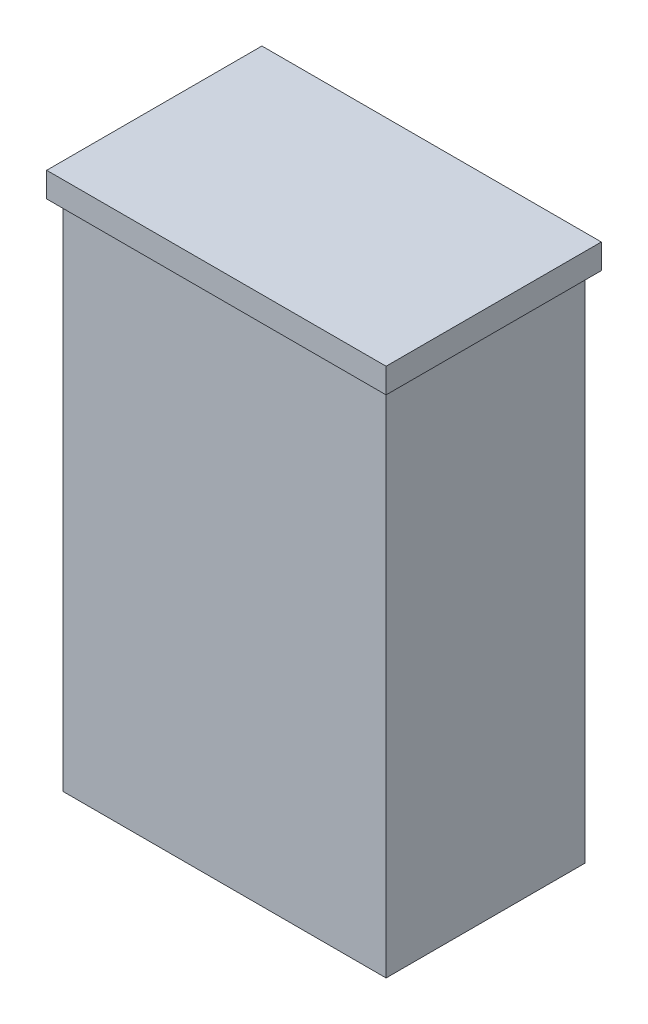
ISO-10303-21;
HEADER;
FILE_DESCRIPTION(('STEP AP214'),'2;1');
FILE_NAME('part.step','',(''),(''),'','','');
FILE_SCHEMA(('AUTOMOTIVE_DESIGN { 1 0 10303 214 1 1 1 1 }'));
ENDSEC;
DATA;
#1=APPLICATION_CONTEXT('core data for automotive mechanical design processes');
#2=APPLICATION_PROTOCOL_DEFINITION('international standard','automotive_design',2000,#1);
#3=PRODUCT_CONTEXT('',#1,'mechanical');
#4=PRODUCT('Part','Part','',(#3));
#5=PRODUCT_RELATED_PRODUCT_CATEGORY('part','',(#4));
#6=PRODUCT_DEFINITION_FORMATION('','',#4);
#7=PRODUCT_DEFINITION_CONTEXT('part definition',#1,'design');
#8=PRODUCT_DEFINITION('design','',#6,#7);
#9=PRODUCT_DEFINITION_SHAPE('','',#8);
#10=(LENGTH_UNIT() NAMED_UNIT(*) SI_UNIT(.MILLI.,.METRE.));
#11=(NAMED_UNIT(*) PLANE_ANGLE_UNIT() SI_UNIT($,.RADIAN.));
#12=(NAMED_UNIT(*) SI_UNIT($,.STERADIAN.) SOLID_ANGLE_UNIT());
#13=UNCERTAINTY_MEASURE_WITH_UNIT(LENGTH_MEASURE(1.E-05),#10,'distance_accuracy_value','');
#14=(GEOMETRIC_REPRESENTATION_CONTEXT(3) GLOBAL_UNCERTAINTY_ASSIGNED_CONTEXT((#13)) GLOBAL_UNIT_ASSIGNED_CONTEXT((#10,
#11,#12)) REPRESENTATION_CONTEXT('',''));
#15=CARTESIAN_POINT('',(0.,0.,0.));
#16=DIRECTION('',(0.,0.,1.));
#17=DIRECTION('',(1.,0.,0.));
#18=AXIS2_PLACEMENT_3D('',#15,#16,#17);
#19=CARTESIAN_POINT('',(-19.5,62.,-12.));
#20=DIRECTION('',(1.,0.,0.));
#21=DIRECTION('',(0.,0.,-1.));
#22=AXIS2_PLACEMENT_3D('',#19,#20,#21);
#23=PLANE('',#22);
#24=DIRECTION('',(0.,0.,1.));
#25=VECTOR('',#24,1.);
#26=CARTESIAN_POINT('',(-19.5,0.,-12.));
#27=LINE('',#26,#25);
#28=CARTESIAN_POINT('',(-19.5,0.,-12.));
#29=VERTEX_POINT('',#28);
#30=CARTESIAN_POINT('',(-19.5,0.,12.));
#31=VERTEX_POINT('',#30);
#32=EDGE_CURVE('E131',#29,#31,#27,.T.);
#33=ORIENTED_EDGE('',*,*,#32,.T.);
#34=DIRECTION('',(0.,-1.,0.));
#35=VECTOR('',#34,1.);
#36=CARTESIAN_POINT('',(-19.5,62.,12.));
#37=LINE('',#36,#35);
#38=CARTESIAN_POINT('',(-19.5,62.,12.));
#39=VERTEX_POINT('',#38);
#40=EDGE_CURVE('E11',#39,#31,#37,.T.);
#41=ORIENTED_EDGE('',*,*,#40,.F.);
#42=DIRECTION('',(0.,0.,1.));
#43=VECTOR('',#42,1.);
#44=CARTESIAN_POINT('',(-19.5,62.,-12.));
#45=LINE('',#44,#43);
#46=CARTESIAN_POINT('',(-19.5,62.,-12.));
#47=VERTEX_POINT('',#46);
#48=EDGE_CURVE('E140',#47,#39,#45,.T.);
#49=ORIENTED_EDGE('',*,*,#48,.F.);
#50=DIRECTION('',(0.,-1.,0.));
#51=VECTOR('',#50,1.);
#52=CARTESIAN_POINT('',(-19.5,62.,-12.));
#53=LINE('',#52,#51);
#54=EDGE_CURVE('E149',#47,#29,#53,.T.);
#55=ORIENTED_EDGE('',*,*,#54,.T.);
#56=EDGE_LOOP('',(#33,#41,#49,#55));
#57=FACE_BOUND('',#56,.T.);
#58=ADVANCED_FACE('F33',(#57),#23,.F.);
#59=CARTESIAN_POINT('',(-19.5,62.,12.));
#60=DIRECTION('',(0.,0.,-1.));
#61=DIRECTION('',(-1.,0.,0.));
#62=AXIS2_PLACEMENT_3D('',#59,#60,#61);
#63=PLANE('',#62);
#64=DIRECTION('',(1.,0.,0.));
#65=VECTOR('',#64,1.);
#66=CARTESIAN_POINT('',(-19.5,0.,12.));
#67=LINE('',#66,#65);
#68=CARTESIAN_POINT('',(19.5,0.,12.));
#69=VERTEX_POINT('',#68);
#70=EDGE_CURVE('E134',#31,#69,#67,.T.);
#71=ORIENTED_EDGE('',*,*,#70,.T.);
#72=DIRECTION('',(0.,-1.,0.));
#73=VECTOR('',#72,1.);
#74=CARTESIAN_POINT('',(19.5,62.,12.));
#75=LINE('',#74,#73);
#76=CARTESIAN_POINT('',(19.5,62.,12.));
#77=VERTEX_POINT('',#76);
#78=EDGE_CURVE('E41',#77,#69,#75,.T.);
#79=ORIENTED_EDGE('',*,*,#78,.F.);
#80=DIRECTION('',(1.,0.,0.));
#81=VECTOR('',#80,1.);
#82=CARTESIAN_POINT('',(-19.5,62.,12.));
#83=LINE('',#82,#81);
#84=EDGE_CURVE('E75',#39,#77,#83,.T.);
#85=ORIENTED_EDGE('',*,*,#84,.F.);
#86=ORIENTED_EDGE('',*,*,#40,.T.);
#87=EDGE_LOOP('',(#71,#79,#85,#86));
#88=FACE_BOUND('',#87,.T.);
#89=ADVANCED_FACE('F175',(#88),#63,.F.);
#90=CARTESIAN_POINT('',(19.5,62.,-12.));
#91=DIRECTION('',(-1.,0.,0.));
#92=DIRECTION('',(0.,0.,1.));
#93=AXIS2_PLACEMENT_3D('',#90,#91,#92);
#94=PLANE('',#93);
#95=DIRECTION('',(0.,0.,-1.));
#96=VECTOR('',#95,1.);
#97=CARTESIAN_POINT('',(19.5,0.,-12.));
#98=LINE('',#97,#96);
#99=CARTESIAN_POINT('',(19.5,0.,-12.));
#100=VERTEX_POINT('',#99);
#101=EDGE_CURVE('E65',#69,#100,#98,.T.);
#102=ORIENTED_EDGE('',*,*,#101,.T.);
#103=DIRECTION('',(0.,-1.,0.));
#104=VECTOR('',#103,1.);
#105=CARTESIAN_POINT('',(19.5,62.,-12.));
#106=LINE('',#105,#104);
#107=CARTESIAN_POINT('',(19.5,62.,-12.));
#108=VERTEX_POINT('',#107);
#109=EDGE_CURVE('E49',#108,#100,#106,.T.);
#110=ORIENTED_EDGE('',*,*,#109,.F.);
#111=DIRECTION('',(0.,0.,-1.));
#112=VECTOR('',#111,1.);
#113=CARTESIAN_POINT('',(19.5,62.,-12.));
#114=LINE('',#113,#112);
#115=EDGE_CURVE('E144',#77,#108,#114,.T.);
#116=ORIENTED_EDGE('',*,*,#115,.F.);
#117=ORIENTED_EDGE('',*,*,#78,.T.);
#118=EDGE_LOOP('',(#102,#110,#116,#117));
#119=FACE_BOUND('',#118,.T.);
#120=ADVANCED_FACE('F155',(#119),#94,.F.);
#121=CARTESIAN_POINT('',(-19.5,62.,-12.));
#122=DIRECTION('',(0.,0.,1.));
#123=DIRECTION('',(1.,0.,0.));
#124=AXIS2_PLACEMENT_3D('',#121,#122,#123);
#125=PLANE('',#124);
#126=DIRECTION('',(-1.,0.,0.));
#127=VECTOR('',#126,1.);
#128=CARTESIAN_POINT('',(-19.5,0.,-12.));
#129=LINE('',#128,#127);
#130=EDGE_CURVE('E70',#100,#29,#129,.T.);
#131=ORIENTED_EDGE('',*,*,#130,.T.);
#132=ORIENTED_EDGE('',*,*,#54,.F.);
#133=DIRECTION('',(-1.,0.,0.));
#134=VECTOR('',#133,1.);
#135=CARTESIAN_POINT('',(-19.5,62.,-12.));
#136=LINE('',#135,#134);
#137=EDGE_CURVE('E147',#108,#47,#136,.T.);
#138=ORIENTED_EDGE('',*,*,#137,.F.);
#139=ORIENTED_EDGE('',*,*,#109,.T.);
#140=EDGE_LOOP('',(#131,#132,#138,#139));
#141=FACE_BOUND('',#140,.T.);
#142=ADVANCED_FACE('F160',(#141),#125,.F.);
#143=CARTESIAN_POINT('',(0.,0.,0.));
#144=DIRECTION('',(0.,1.,0.));
#145=DIRECTION('',(0.,0.,1.));
#146=AXIS2_PLACEMENT_3D('',#143,#144,#145);
#147=PLANE('',#146);
#148=ORIENTED_EDGE('',*,*,#32,.F.);
#149=ORIENTED_EDGE('',*,*,#130,.F.);
#150=ORIENTED_EDGE('',*,*,#101,.F.);
#151=ORIENTED_EDGE('',*,*,#70,.F.);
#152=EDGE_LOOP('',(#148,#149,#150,#151));
#153=FACE_BOUND('',#152,.T.);
#154=ADVANCED_FACE('F158',(#153),#147,.F.);
#155=CARTESIAN_POINT('',(0.,62.,0.));
#156=DIRECTION('',(0.,1.,0.));
#157=DIRECTION('',(0.,0.,1.));
#158=AXIS2_PLACEMENT_3D('',#155,#156,#157);
#159=PLANE('',#158);
#160=DIRECTION('',(-1.,0.,0.));
#161=VECTOR('',#160,1.);
#162=CARTESIAN_POINT('',(20.5,62.,-13.));
#163=LINE('',#162,#161);
#164=CARTESIAN_POINT('',(20.5,62.,-13.));
#165=VERTEX_POINT('',#164);
#166=CARTESIAN_POINT('',(-20.5,62.,-13.));
#167=VERTEX_POINT('',#166);
#168=EDGE_CURVE('E130',#165,#167,#163,.T.);
#169=ORIENTED_EDGE('',*,*,#168,.F.);
#170=DIRECTION('',(0.,0.,-1.));
#171=VECTOR('',#170,1.);
#172=CARTESIAN_POINT('',(20.5,62.,13.));
#173=LINE('',#172,#171);
#174=CARTESIAN_POINT('',(20.5,62.,13.));
#175=VERTEX_POINT('',#174);
#176=EDGE_CURVE('E126',#175,#165,#173,.T.);
#177=ORIENTED_EDGE('',*,*,#176,.F.);
#178=DIRECTION('',(1.,0.,0.));
#179=VECTOR('',#178,1.);
#180=CARTESIAN_POINT('',(-20.5,62.,13.));
#181=LINE('',#180,#179);
#182=CARTESIAN_POINT('',(-20.5,62.,13.));
#183=VERTEX_POINT('',#182);
#184=EDGE_CURVE('E202',#183,#175,#181,.T.);
#185=ORIENTED_EDGE('',*,*,#184,.F.);
#186=DIRECTION('',(0.,0.,1.));
#187=VECTOR('',#186,1.);
#188=CARTESIAN_POINT('',(-20.5,62.,-13.));
#189=LINE('',#188,#187);
#190=EDGE_CURVE('E205',#167,#183,#189,.T.);
#191=ORIENTED_EDGE('',*,*,#190,.F.);
#192=EDGE_LOOP('',(#169,#177,#185,#191));
#193=FACE_BOUND('',#192,.T.);
#194=ORIENTED_EDGE('',*,*,#137,.T.);
#195=ORIENTED_EDGE('',*,*,#48,.T.);
#196=ORIENTED_EDGE('',*,*,#84,.T.);
#197=ORIENTED_EDGE('',*,*,#115,.T.);
#198=EDGE_LOOP('',(#194,#195,#196,#197));
#199=FACE_BOUND('',#198,.T.);
#200=ADVANCED_FACE('F162',(#193,#199),#159,.F.);
#201=CARTESIAN_POINT('',(20.5,65.,-13.));
#202=DIRECTION('',(0.,0.,1.));
#203=DIRECTION('',(1.,0.,0.));
#204=AXIS2_PLACEMENT_3D('',#201,#202,#203);
#205=PLANE('',#204);
#206=ORIENTED_EDGE('',*,*,#168,.T.);
#207=DIRECTION('',(0.,-1.,0.));
#208=VECTOR('',#207,1.);
#209=CARTESIAN_POINT('',(-20.5,65.,-13.));
#210=LINE('',#209,#208);
#211=CARTESIAN_POINT('',(-20.5,65.,-13.));
#212=VERTEX_POINT('',#211);
#213=EDGE_CURVE('E110',#212,#167,#210,.T.);
#214=ORIENTED_EDGE('',*,*,#213,.F.);
#215=DIRECTION('',(-1.,0.,0.));
#216=VECTOR('',#215,1.);
#217=CARTESIAN_POINT('',(20.5,65.,-13.));
#218=LINE('',#217,#216);
#219=CARTESIAN_POINT('',(20.5,65.,-13.));
#220=VERTEX_POINT('',#219);
#221=EDGE_CURVE('E117',#220,#212,#218,.T.);
#222=ORIENTED_EDGE('',*,*,#221,.F.);
#223=DIRECTION('',(0.,-1.,0.));
#224=VECTOR('',#223,1.);
#225=CARTESIAN_POINT('',(20.5,65.,-13.));
#226=LINE('',#225,#224);
#227=EDGE_CURVE('E199',#220,#165,#226,.T.);
#228=ORIENTED_EDGE('',*,*,#227,.T.);
#229=EDGE_LOOP('',(#206,#214,#222,#228));
#230=FACE_BOUND('',#229,.T.);
#231=ADVANCED_FACE('F128',(#230),#205,.F.);
#232=CARTESIAN_POINT('',(-20.5,65.,-13.));
#233=DIRECTION('',(1.,0.,0.));
#234=DIRECTION('',(0.,0.,-1.));
#235=AXIS2_PLACEMENT_3D('',#232,#233,#234);
#236=PLANE('',#235);
#237=ORIENTED_EDGE('',*,*,#190,.T.);
#238=DIRECTION('',(0.,-1.,0.));
#239=VECTOR('',#238,1.);
#240=CARTESIAN_POINT('',(-20.5,65.,13.));
#241=LINE('',#240,#239);
#242=CARTESIAN_POINT('',(-20.5,65.,13.));
#243=VERTEX_POINT('',#242);
#244=EDGE_CURVE('E113',#243,#183,#241,.T.);
#245=ORIENTED_EDGE('',*,*,#244,.F.);
#246=DIRECTION('',(0.,0.,1.));
#247=VECTOR('',#246,1.);
#248=CARTESIAN_POINT('',(-20.5,65.,-13.));
#249=LINE('',#248,#247);
#250=EDGE_CURVE('E106',#212,#243,#249,.T.);
#251=ORIENTED_EDGE('',*,*,#250,.F.);
#252=ORIENTED_EDGE('',*,*,#213,.T.);
#253=EDGE_LOOP('',(#237,#245,#251,#252));
#254=FACE_BOUND('',#253,.T.);
#255=ADVANCED_FACE('F108',(#254),#236,.F.);
#256=CARTESIAN_POINT('',(-20.5,65.,13.));
#257=DIRECTION('',(0.,0.,-1.));
#258=DIRECTION('',(-1.,0.,0.));
#259=AXIS2_PLACEMENT_3D('',#256,#257,#258);
#260=PLANE('',#259);
#261=ORIENTED_EDGE('',*,*,#184,.T.);
#262=DIRECTION('',(0.,-1.,0.));
#263=VECTOR('',#262,1.);
#264=CARTESIAN_POINT('',(20.5,65.,13.));
#265=LINE('',#264,#263);
#266=CARTESIAN_POINT('',(20.5,65.,13.));
#267=VERTEX_POINT('',#266);
#268=EDGE_CURVE('E136',#267,#175,#265,.T.);
#269=ORIENTED_EDGE('',*,*,#268,.F.);
#270=DIRECTION('',(1.,0.,0.));
#271=VECTOR('',#270,1.);
#272=CARTESIAN_POINT('',(-20.5,65.,13.));
#273=LINE('',#272,#271);
#274=EDGE_CURVE('E116',#243,#267,#273,.T.);
#275=ORIENTED_EDGE('',*,*,#274,.F.);
#276=ORIENTED_EDGE('',*,*,#244,.T.);
#277=EDGE_LOOP('',(#261,#269,#275,#276));
#278=FACE_BOUND('',#277,.T.);
#279=ADVANCED_FACE('F188',(#278),#260,.F.);
#280=CARTESIAN_POINT('',(20.5,65.,13.));
#281=DIRECTION('',(-1.,0.,0.));
#282=DIRECTION('',(0.,0.,1.));
#283=AXIS2_PLACEMENT_3D('',#280,#281,#282);
#284=PLANE('',#283);
#285=ORIENTED_EDGE('',*,*,#176,.T.);
#286=ORIENTED_EDGE('',*,*,#227,.F.);
#287=DIRECTION('',(0.,0.,-1.));
#288=VECTOR('',#287,1.);
#289=CARTESIAN_POINT('',(20.5,65.,13.));
#290=LINE('',#289,#288);
#291=EDGE_CURVE('E122',#267,#220,#290,.T.);
#292=ORIENTED_EDGE('',*,*,#291,.F.);
#293=ORIENTED_EDGE('',*,*,#268,.T.);
#294=EDGE_LOOP('',(#285,#286,#292,#293));
#295=FACE_BOUND('',#294,.T.);
#296=ADVANCED_FACE('F190',(#295),#284,.F.);
#297=CARTESIAN_POINT('',(0.,65.,0.));
#298=DIRECTION('',(0.,1.,0.));
#299=DIRECTION('',(0.,0.,1.));
#300=AXIS2_PLACEMENT_3D('',#297,#298,#299);
#301=PLANE('',#300);
#302=ORIENTED_EDGE('',*,*,#221,.T.);
#303=ORIENTED_EDGE('',*,*,#250,.T.);
#304=ORIENTED_EDGE('',*,*,#274,.T.);
#305=ORIENTED_EDGE('',*,*,#291,.T.);
#306=EDGE_LOOP('',(#302,#303,#304,#305));
#307=FACE_BOUND('',#306,.T.);
#308=ADVANCED_FACE('F120',(#307),#301,.T.);
#309=CLOSED_SHELL('',(#58,#89,#120,#142,#154,#200,#231,#255,#279,#296,#308));
#310=MANIFOLD_SOLID_BREP('B2',#309);
#311=ADVANCED_BREP_SHAPE_REPRESENTATION('',(#18,#310),#14);
#312=SHAPE_DEFINITION_REPRESENTATION(#9,#311);
ENDSEC;
END-ISO-10303-21;
